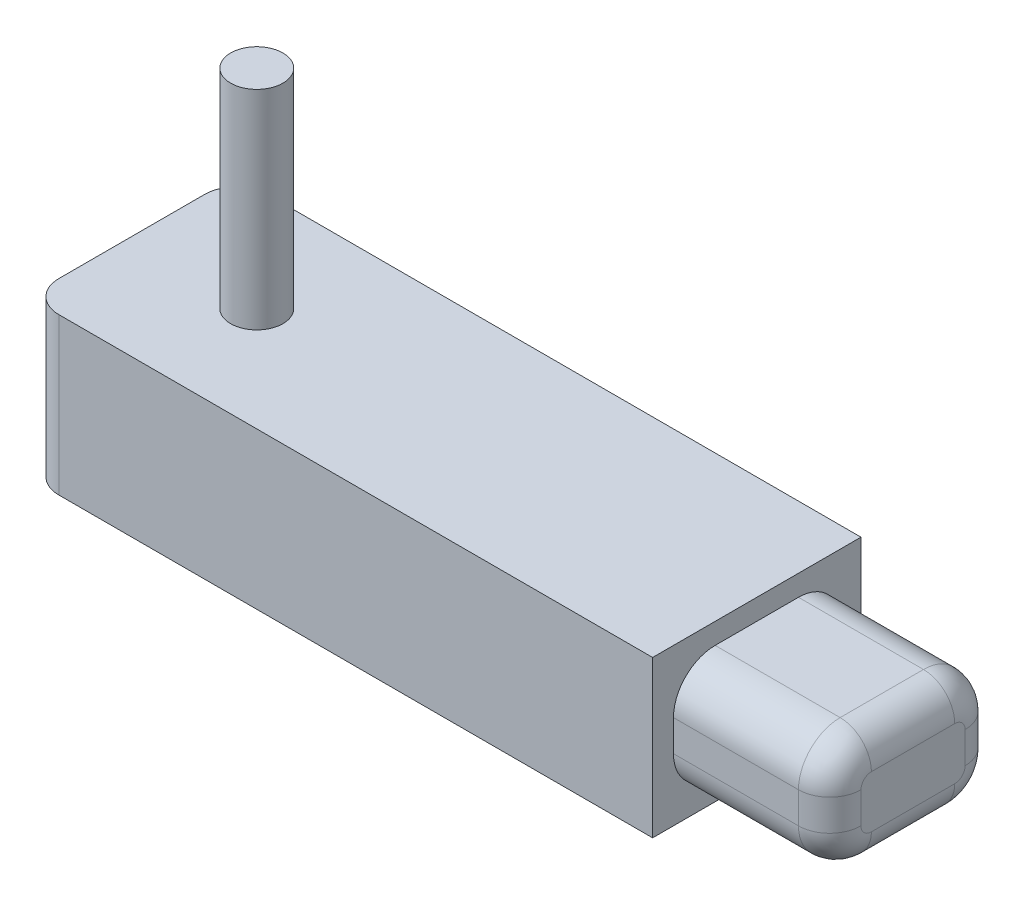
ISO-10303-21;
HEADER;
FILE_DESCRIPTION(('STEP AP214'),'2;1');
FILE_NAME('part.step','',(''),(''),'','','');
FILE_SCHEMA(('AUTOMOTIVE_DESIGN { 1 0 10303 214 1 1 1 1 }'));
ENDSEC;
DATA;
#1=APPLICATION_CONTEXT('core data for automotive mechanical design processes');
#2=APPLICATION_PROTOCOL_DEFINITION('international standard','automotive_design',2000,#1);
#3=PRODUCT_CONTEXT('',#1,'mechanical');
#4=PRODUCT('Part','Part','',(#3));
#5=PRODUCT_RELATED_PRODUCT_CATEGORY('part','',(#4));
#6=PRODUCT_DEFINITION_FORMATION('','',#4);
#7=PRODUCT_DEFINITION_CONTEXT('part definition',#1,'design');
#8=PRODUCT_DEFINITION('design','',#6,#7);
#9=PRODUCT_DEFINITION_SHAPE('','',#8);
#10=(LENGTH_UNIT() NAMED_UNIT(*) SI_UNIT(.MILLI.,.METRE.));
#11=(NAMED_UNIT(*) PLANE_ANGLE_UNIT() SI_UNIT($,.RADIAN.));
#12=(NAMED_UNIT(*) SI_UNIT($,.STERADIAN.) SOLID_ANGLE_UNIT());
#13=UNCERTAINTY_MEASURE_WITH_UNIT(LENGTH_MEASURE(1.E-05),#10,'distance_accuracy_value','');
#14=(GEOMETRIC_REPRESENTATION_CONTEXT(3) GLOBAL_UNCERTAINTY_ASSIGNED_CONTEXT((#13)) GLOBAL_UNIT_ASSIGNED_CONTEXT((#10,
#11,#12)) REPRESENTATION_CONTEXT('',''));
#15=CARTESIAN_POINT('',(0.,0.,0.));
#16=DIRECTION('',(0.,0.,1.));
#17=DIRECTION('',(1.,0.,0.));
#18=AXIS2_PLACEMENT_3D('',#15,#16,#17);
#19=CARTESIAN_POINT('',(10.875,7.0300987640225,20.));
#20=DIRECTION('',(-1.,0.,0.));
#21=DIRECTION('',(0.,-1.,0.));
#22=AXIS2_PLACEMENT_3D('',#19,#20,#21);
#23=PLANE('',#22);
#24=DIRECTION('',(0.,1.,0.));
#25=VECTOR('',#24,1.);
#26=CARTESIAN_POINT('',(10.875,7.0300987640225,0.));
#27=LINE('',#26,#25);
#28=CARTESIAN_POINT('',(10.875,-7.9699012359775,0.));
#29=VERTEX_POINT('',#28);
#30=CARTESIAN_POINT('',(10.875,7.0300987640225,0.));
#31=VERTEX_POINT('',#30);
#32=EDGE_CURVE('E210',#29,#31,#27,.T.);
#33=ORIENTED_EDGE('',*,*,#32,.T.);
#34=DIRECTION('',(0.,0.,-1.));
#35=VECTOR('',#34,1.);
#36=CARTESIAN_POINT('',(10.875,7.0300987640225,20.));
#37=LINE('',#36,#35);
#38=CARTESIAN_POINT('',(10.875,7.0300987640225,20.));
#39=VERTEX_POINT('',#38);
#40=EDGE_CURVE('E195',#39,#31,#37,.T.);
#41=ORIENTED_EDGE('',*,*,#40,.F.);
#42=DIRECTION('',(0.,1.,0.));
#43=VECTOR('',#42,1.);
#44=CARTESIAN_POINT('',(10.875,7.0300987640225,20.));
#45=LINE('',#44,#43);
#46=CARTESIAN_POINT('',(10.875,-7.9699012359775,20.));
#47=VERTEX_POINT('',#46);
#48=EDGE_CURVE('E179',#47,#39,#45,.T.);
#49=ORIENTED_EDGE('',*,*,#48,.F.);
#50=DIRECTION('',(0.,0.,-1.));
#51=VECTOR('',#50,1.);
#52=CARTESIAN_POINT('',(10.875,-7.9699012359775,20.));
#53=LINE('',#52,#51);
#54=EDGE_CURVE('E188',#47,#29,#53,.T.);
#55=ORIENTED_EDGE('',*,*,#54,.T.);
#56=EDGE_LOOP('',(#33,#41,#49,#55));
#57=FACE_BOUND('',#56,.T.);
#58=DIRECTION('',(0.,1.,0.));
#59=VECTOR('',#58,1.);
#60=CARTESIAN_POINT('',(10.875,-5.9699012359775,2.));
#61=LINE('',#60,#59);
#62=CARTESIAN_POINT('',(10.875,-1.9699012359775,2.));
#63=VERTEX_POINT('',#62);
#64=CARTESIAN_POINT('',(10.875,1.0300987640225,2.));
#65=VERTEX_POINT('',#64);
#66=EDGE_CURVE('E348',#63,#65,#61,.T.);
#67=ORIENTED_EDGE('',*,*,#66,.F.);
#68=CARTESIAN_POINT('',(10.875,-1.9699012359775,6.));
#69=DIRECTION('',(-1.,0.,0.));
#70=DIRECTION('',(0.,-1.,0.));
#71=AXIS2_PLACEMENT_3D('',#68,#69,#70);
#72=CIRCLE('',#71,4.);
#73=CARTESIAN_POINT('',(10.875,-5.9699012359775,6.));
#74=VERTEX_POINT('',#73);
#75=EDGE_CURVE('E265',#63,#74,#72,.T.);
#76=ORIENTED_EDGE('',*,*,#75,.T.);
#77=DIRECTION('',(0.,0.,-1.));
#78=VECTOR('',#77,1.);
#79=CARTESIAN_POINT('',(10.875,-5.9699012359775,18.));
#80=LINE('',#79,#78);
#81=CARTESIAN_POINT('',(10.875,-5.9699012359775,14.));
#82=VERTEX_POINT('',#81);
#83=EDGE_CURVE('E676',#82,#74,#80,.T.);
#84=ORIENTED_EDGE('',*,*,#83,.F.);
#85=CARTESIAN_POINT('',(10.875,-1.9699012359775,14.));
#86=DIRECTION('',(-1.,0.,0.));
#87=DIRECTION('',(0.,-1.,0.));
#88=AXIS2_PLACEMENT_3D('',#85,#86,#87);
#89=CIRCLE('',#88,4.);
#90=CARTESIAN_POINT('',(10.875,-1.9699012359775,18.));
#91=VERTEX_POINT('',#90);
#92=EDGE_CURVE('E262',#82,#91,#89,.T.);
#93=ORIENTED_EDGE('',*,*,#92,.T.);
#94=DIRECTION('',(0.,-1.,0.));
#95=VECTOR('',#94,1.);
#96=CARTESIAN_POINT('',(10.875,-5.9699012359775,18.));
#97=LINE('',#96,#95);
#98=CARTESIAN_POINT('',(10.875,1.0300987640225,18.));
#99=VERTEX_POINT('',#98);
#100=EDGE_CURVE('E679',#99,#91,#97,.T.);
#101=ORIENTED_EDGE('',*,*,#100,.F.);
#102=CARTESIAN_POINT('',(10.875,1.0300987640225,14.));
#103=DIRECTION('',(-1.,0.,0.));
#104=DIRECTION('',(0.,-1.,0.));
#105=AXIS2_PLACEMENT_3D('',#102,#103,#104);
#106=CIRCLE('',#105,4.);
#107=CARTESIAN_POINT('',(10.875,5.0300987640225,14.));
#108=VERTEX_POINT('',#107);
#109=EDGE_CURVE('E245',#99,#108,#106,.T.);
#110=ORIENTED_EDGE('',*,*,#109,.T.);
#111=DIRECTION('',(0.,0.,1.));
#112=VECTOR('',#111,1.);
#113=CARTESIAN_POINT('',(10.875,5.0300987640225,18.));
#114=LINE('',#113,#112);
#115=CARTESIAN_POINT('',(10.875,5.0300987640225,6.));
#116=VERTEX_POINT('',#115);
#117=EDGE_CURVE('E685',#116,#108,#114,.T.);
#118=ORIENTED_EDGE('',*,*,#117,.F.);
#119=CARTESIAN_POINT('',(10.875,1.0300987640225,6.));
#120=DIRECTION('',(-1.,0.,0.));
#121=DIRECTION('',(0.,-1.,0.));
#122=AXIS2_PLACEMENT_3D('',#119,#120,#121);
#123=CIRCLE('',#122,4.);
#124=EDGE_CURVE('E234',#116,#65,#123,.T.);
#125=ORIENTED_EDGE('',*,*,#124,.T.);
#126=EDGE_LOOP('',(#67,#76,#84,#93,#101,#110,#118,#125));
#127=FACE_BOUND('',#126,.T.);
#128=ADVANCED_FACE('F47',(#57,#127),#23,.F.);
#129=CARTESIAN_POINT('',(-49.125,-7.96990123597754,20.));
#130=DIRECTION('',(1.,0.,0.));
#131=DIRECTION('',(0.,0.,-1.));
#132=AXIS2_PLACEMENT_3D('',#129,#130,#131);
#133=PLANE('',#132);
#134=DIRECTION('',(0.,0.,-1.));
#135=VECTOR('',#134,1.);
#136=CARTESIAN_POINT('',(-49.125,-7.96990123597754,20.));
#137=LINE('',#136,#135);
#138=CARTESIAN_POINT('',(-49.125,-7.96990123597754,17.));
#139=VERTEX_POINT('',#138);
#140=CARTESIAN_POINT('',(-49.125,-7.96990123597754,3.));
#141=VERTEX_POINT('',#140);
#142=EDGE_CURVE('E194',#139,#141,#137,.T.);
#143=ORIENTED_EDGE('',*,*,#142,.F.);
#144=DIRECTION('',(0.,-1.,0.));
#145=VECTOR('',#144,1.);
#146=CARTESIAN_POINT('',(-49.125,-7.96990123597754,17.));
#147=LINE('',#146,#145);
#148=CARTESIAN_POINT('',(-49.125,7.03009876402245,17.));
#149=VERTEX_POINT('',#148);
#150=EDGE_CURVE('E361',#139,#149,#147,.F.);
#151=ORIENTED_EDGE('',*,*,#150,.T.);
#152=DIRECTION('',(0.,0.,-1.));
#153=VECTOR('',#152,1.);
#154=CARTESIAN_POINT('',(-49.125,7.03009876402245,20.));
#155=LINE('',#154,#153);
#156=CARTESIAN_POINT('',(-49.125,7.03009876402245,3.));
#157=VERTEX_POINT('',#156);
#158=EDGE_CURVE('E204',#149,#157,#155,.T.);
#159=ORIENTED_EDGE('',*,*,#158,.T.);
#160=DIRECTION('',(0.,-1.,0.));
#161=VECTOR('',#160,1.);
#162=CARTESIAN_POINT('',(-49.125,-7.96990123597754,3.));
#163=LINE('',#162,#161);
#164=EDGE_CURVE('E357',#157,#141,#163,.T.);
#165=ORIENTED_EDGE('',*,*,#164,.T.);
#166=EDGE_LOOP('',(#143,#151,#159,#165));
#167=FACE_BOUND('',#166,.T.);
#168=ADVANCED_FACE('F373',(#167),#133,.F.);
#169=CARTESIAN_POINT('',(10.875,-7.9699012359775,20.));
#170=DIRECTION('',(0.,1.,0.));
#171=DIRECTION('',(-1.,0.,0.));
#172=AXIS2_PLACEMENT_3D('',#169,#170,#171);
#173=PLANE('',#172);
#174=DIRECTION('',(1.,0.,0.));
#175=VECTOR('',#174,1.);
#176=CARTESIAN_POINT('',(10.875,-7.9699012359775,20.));
#177=LINE('',#176,#175);
#178=CARTESIAN_POINT('',(-46.125,-7.96990123597754,20.));
#179=VERTEX_POINT('',#178);
#180=EDGE_CURVE('E174',#179,#47,#177,.T.);
#181=ORIENTED_EDGE('',*,*,#180,.F.);
#182=CARTESIAN_POINT('',(-46.125,-7.96990123597754,17.));
#183=DIRECTION('',(0.,1.,0.));
#184=DIRECTION('',(-1.,0.,0.));
#185=AXIS2_PLACEMENT_3D('',#182,#183,#184);
#186=CIRCLE('',#185,3.);
#187=EDGE_CURVE('E354',#179,#139,#186,.F.);
#188=ORIENTED_EDGE('',*,*,#187,.T.);
#189=ORIENTED_EDGE('',*,*,#142,.T.);
#190=CARTESIAN_POINT('',(-46.125,-7.96990123597754,3.));
#191=DIRECTION('',(0.,1.,0.));
#192=DIRECTION('',(-1.,0.,0.));
#193=AXIS2_PLACEMENT_3D('',#190,#191,#192);
#194=CIRCLE('',#193,3.);
#195=CARTESIAN_POINT('',(-46.125,-7.96990123597754,0.));
#196=VERTEX_POINT('',#195);
#197=EDGE_CURVE('E351',#141,#196,#194,.F.);
#198=ORIENTED_EDGE('',*,*,#197,.T.);
#199=DIRECTION('',(1.,0.,0.));
#200=VECTOR('',#199,1.);
#201=CARTESIAN_POINT('',(10.875,-7.9699012359775,0.));
#202=LINE('',#201,#200);
#203=EDGE_CURVE('E190',#196,#29,#202,.T.);
#204=ORIENTED_EDGE('',*,*,#203,.T.);
#205=ORIENTED_EDGE('',*,*,#54,.F.);
#206=EDGE_LOOP('',(#181,#188,#189,#198,#204,#205));
#207=FACE_BOUND('',#206,.T.);
#208=ADVANCED_FACE('F189',(#207),#173,.F.);
#209=CARTESIAN_POINT('',(-49.125,7.03009876402245,20.));
#210=DIRECTION('',(0.,-1.,0.));
#211=DIRECTION('',(1.,0.,0.));
#212=AXIS2_PLACEMENT_3D('',#209,#210,#211);
#213=PLANE('',#212);
#214=CARTESIAN_POINT('',(-37.125,7.03009876402247,10.));
#215=DIRECTION('',(0.,-1.,0.));
#216=DIRECTION('',(1.,0.,0.));
#217=AXIS2_PLACEMENT_3D('',#214,#215,#216);
#218=CIRCLE('',#217,2.5097667527526);
#219=CARTESIAN_POINT('',(-34.6152332472474,7.03009876402247,10.));
#220=VERTEX_POINT('',#219);
#221=EDGE_CURVE('E223',#220,#220,#218,.F.);
#222=ORIENTED_EDGE('',*,*,#221,.F.);
#223=EDGE_LOOP('',(#222));
#224=FACE_BOUND('',#223,.T.);
#225=ORIENTED_EDGE('',*,*,#158,.F.);
#226=CARTESIAN_POINT('',(-46.125,7.03009876402246,17.));
#227=DIRECTION('',(0.,-1.,0.));
#228=DIRECTION('',(1.,0.,0.));
#229=AXIS2_PLACEMENT_3D('',#226,#227,#228);
#230=CIRCLE('',#229,3.);
#231=CARTESIAN_POINT('',(-46.125,7.03009876402246,20.));
#232=VERTEX_POINT('',#231);
#233=EDGE_CURVE('E56',#149,#232,#230,.F.);
#234=ORIENTED_EDGE('',*,*,#233,.T.);
#235=DIRECTION('',(-1.,0.,0.));
#236=VECTOR('',#235,1.);
#237=CARTESIAN_POINT('',(-49.125,7.03009876402245,20.));
#238=LINE('',#237,#236);
#239=EDGE_CURVE('E201',#39,#232,#238,.T.);
#240=ORIENTED_EDGE('',*,*,#239,.F.);
#241=ORIENTED_EDGE('',*,*,#40,.T.);
#242=DIRECTION('',(-1.,0.,0.));
#243=VECTOR('',#242,1.);
#244=CARTESIAN_POINT('',(-49.125,7.03009876402245,0.));
#245=LINE('',#244,#243);
#246=CARTESIAN_POINT('',(-46.125,7.03009876402246,0.));
#247=VERTEX_POINT('',#246);
#248=EDGE_CURVE('E185',#31,#247,#245,.T.);
#249=ORIENTED_EDGE('',*,*,#248,.T.);
#250=CARTESIAN_POINT('',(-46.125,7.03009876402246,3.));
#251=DIRECTION('',(0.,-1.,0.));
#252=DIRECTION('',(1.,0.,0.));
#253=AXIS2_PLACEMENT_3D('',#250,#251,#252);
#254=CIRCLE('',#253,3.);
#255=EDGE_CURVE('E68',#247,#157,#254,.F.);
#256=ORIENTED_EDGE('',*,*,#255,.T.);
#257=EDGE_LOOP('',(#225,#234,#240,#241,#249,#256));
#258=FACE_BOUND('',#257,.T.);
#259=ADVANCED_FACE('F367',(#224,#258),#213,.F.);
#260=CARTESIAN_POINT('',(0.,0.,20.));
#261=DIRECTION('',(0.,0.,-1.));
#262=DIRECTION('',(-1.,0.,0.));
#263=AXIS2_PLACEMENT_3D('',#260,#261,#262);
#264=PLANE('',#263);
#265=ORIENTED_EDGE('',*,*,#239,.T.);
#266=DIRECTION('',(0.,-1.,0.));
#267=VECTOR('',#266,1.);
#268=CARTESIAN_POINT('',(-46.125,0.,20.));
#269=LINE('',#268,#267);
#270=EDGE_CURVE('E182',#232,#179,#269,.T.);
#271=ORIENTED_EDGE('',*,*,#270,.T.);
#272=ORIENTED_EDGE('',*,*,#180,.T.);
#273=ORIENTED_EDGE('',*,*,#48,.T.);
#274=EDGE_LOOP('',(#265,#271,#272,#273));
#275=FACE_BOUND('',#274,.T.);
#276=ADVANCED_FACE('F177',(#275),#264,.F.);
#277=CARTESIAN_POINT('',(0.,0.,0.));
#278=DIRECTION('',(0.,0.,-1.));
#279=DIRECTION('',(-1.,0.,0.));
#280=AXIS2_PLACEMENT_3D('',#277,#278,#279);
#281=PLANE('',#280);
#282=ORIENTED_EDGE('',*,*,#203,.F.);
#283=DIRECTION('',(0.,-1.,0.));
#284=VECTOR('',#283,1.);
#285=CARTESIAN_POINT('',(-46.125,7.03009876402245,0.));
#286=LINE('',#285,#284);
#287=EDGE_CURVE('E11',#196,#247,#286,.F.);
#288=ORIENTED_EDGE('',*,*,#287,.T.);
#289=ORIENTED_EDGE('',*,*,#248,.F.);
#290=ORIENTED_EDGE('',*,*,#32,.F.);
#291=EDGE_LOOP('',(#282,#288,#289,#290));
#292=FACE_BOUND('',#291,.T.);
#293=ADVANCED_FACE('F376',(#292),#281,.T.);
#294=CARTESIAN_POINT('',(-37.125,27.0300987640225,10.));
#295=DIRECTION('',(0.,-1.,0.));
#296=DIRECTION('',(1.,0.,0.));
#297=AXIS2_PLACEMENT_3D('',#294,#295,#296);
#298=CYLINDRICAL_SURFACE('',#297,2.5097667527526);
#299=CARTESIAN_POINT('',(-37.125,27.0300987640225,10.));
#300=DIRECTION('',(0.,1.,0.));
#301=DIRECTION('',(-1.,0.,0.));
#302=AXIS2_PLACEMENT_3D('',#299,#300,#301);
#303=CIRCLE('',#302,2.5097667527526);
#304=CARTESIAN_POINT('',(-39.6347667527526,27.0300987640225,10.));
#305=VERTEX_POINT('',#304);
#306=EDGE_CURVE('E211',#305,#305,#303,.T.);
#307=ORIENTED_EDGE('',*,*,#306,.F.);
#308=EDGE_LOOP('',(#307));
#309=FACE_BOUND('',#308,.T.);
#310=ORIENTED_EDGE('',*,*,#221,.T.);
#311=EDGE_LOOP('',(#310));
#312=FACE_BOUND('',#311,.T.);
#313=ADVANCED_FACE('F378',(#309,#312),#298,.T.);
#314=CARTESIAN_POINT('',(0.,27.0300987640225,0.));
#315=DIRECTION('',(0.,1.,0.));
#316=DIRECTION('',(-1.,0.,0.));
#317=AXIS2_PLACEMENT_3D('',#314,#315,#316);
#318=PLANE('',#317);
#319=ORIENTED_EDGE('',*,*,#306,.T.);
#320=EDGE_LOOP('',(#319));
#321=FACE_BOUND('',#320,.T.);
#322=ADVANCED_FACE('F384',(#321),#318,.T.);
#323=CARTESIAN_POINT('',(25.875,-5.96990123597749,2.));
#324=DIRECTION('',(0.,0.,1.));
#325=DIRECTION('',(1.,0.,0.));
#326=AXIS2_PLACEMENT_3D('',#323,#324,#325);
#327=PLANE('',#326);
#328=DIRECTION('',(-1.,0.,0.));
#329=VECTOR('',#328,1.);
#330=CARTESIAN_POINT('',(25.875,1.03009876402251,2.));
#331=LINE('',#330,#329);
#332=CARTESIAN_POINT('',(22.875,1.0300987640225,2.));
#333=VERTEX_POINT('',#332);
#334=EDGE_CURVE('E230',#65,#333,#331,.F.);
#335=ORIENTED_EDGE('',*,*,#334,.T.);
#336=DIRECTION('',(0.,1.,0.));
#337=VECTOR('',#336,1.);
#338=CARTESIAN_POINT('',(22.875,-5.9699012359775,2.));
#339=LINE('',#338,#337);
#340=CARTESIAN_POINT('',(22.875,-1.9699012359775,2.));
#341=VERTEX_POINT('',#340);
#342=EDGE_CURVE('E297',#333,#341,#339,.F.);
#343=ORIENTED_EDGE('',*,*,#342,.T.);
#344=DIRECTION('',(-1.,0.,0.));
#345=VECTOR('',#344,1.);
#346=CARTESIAN_POINT('',(25.875,-1.96990123597749,2.));
#347=LINE('',#346,#345);
#348=EDGE_CURVE('E259',#341,#63,#347,.T.);
#349=ORIENTED_EDGE('',*,*,#348,.T.);
#350=ORIENTED_EDGE('',*,*,#66,.T.);
#351=EDGE_LOOP('',(#335,#343,#349,#350));
#352=FACE_BOUND('',#351,.T.);
#353=ADVANCED_FACE('F621',(#352),#327,.F.);
#354=CARTESIAN_POINT('',(25.875,5.03009876402251,18.));
#355=DIRECTION('',(0.,-1.,0.));
#356=DIRECTION('',(1.,0.,0.));
#357=AXIS2_PLACEMENT_3D('',#354,#355,#356);
#358=PLANE('',#357);
#359=DIRECTION('',(-1.,0.,0.));
#360=VECTOR('',#359,1.);
#361=CARTESIAN_POINT('',(25.875,5.03009876402251,14.));
#362=LINE('',#361,#360);
#363=CARTESIAN_POINT('',(22.875,5.03009876402251,14.));
#364=VERTEX_POINT('',#363);
#365=EDGE_CURVE('E241',#108,#364,#362,.F.);
#366=ORIENTED_EDGE('',*,*,#365,.T.);
#367=DIRECTION('',(0.,0.,1.));
#368=VECTOR('',#367,1.);
#369=CARTESIAN_POINT('',(22.875,5.03009876402251,18.));
#370=LINE('',#369,#368);
#371=CARTESIAN_POINT('',(22.875,5.03009876402251,6.));
#372=VERTEX_POINT('',#371);
#373=EDGE_CURVE('E315',#364,#372,#370,.F.);
#374=ORIENTED_EDGE('',*,*,#373,.T.);
#375=DIRECTION('',(-1.,0.,0.));
#376=VECTOR('',#375,1.);
#377=CARTESIAN_POINT('',(25.875,5.03009876402251,6.));
#378=LINE('',#377,#376);
#379=EDGE_CURVE('E227',#372,#116,#378,.T.);
#380=ORIENTED_EDGE('',*,*,#379,.T.);
#381=ORIENTED_EDGE('',*,*,#117,.T.);
#382=EDGE_LOOP('',(#366,#374,#380,#381));
#383=FACE_BOUND('',#382,.T.);
#384=ADVANCED_FACE('F611',(#383),#358,.F.);
#385=CARTESIAN_POINT('',(25.875,-5.96990123597749,18.));
#386=DIRECTION('',(0.,0.,-1.));
#387=DIRECTION('',(-1.,0.,0.));
#388=AXIS2_PLACEMENT_3D('',#385,#386,#387);
#389=PLANE('',#388);
#390=DIRECTION('',(-1.,0.,0.));
#391=VECTOR('',#390,1.);
#392=CARTESIAN_POINT('',(25.875,-1.96990123597749,18.));
#393=LINE('',#392,#391);
#394=CARTESIAN_POINT('',(22.875,-1.9699012359775,18.));
#395=VERTEX_POINT('',#394);
#396=EDGE_CURVE('E255',#91,#395,#393,.F.);
#397=ORIENTED_EDGE('',*,*,#396,.T.);
#398=DIRECTION('',(0.,-1.,0.));
#399=VECTOR('',#398,1.);
#400=CARTESIAN_POINT('',(22.875,-5.9699012359775,18.));
#401=LINE('',#400,#399);
#402=CARTESIAN_POINT('',(22.875,1.0300987640225,18.));
#403=VERTEX_POINT('',#402);
#404=EDGE_CURVE('E309',#395,#403,#401,.F.);
#405=ORIENTED_EDGE('',*,*,#404,.T.);
#406=DIRECTION('',(-1.,0.,0.));
#407=VECTOR('',#406,1.);
#408=CARTESIAN_POINT('',(25.875,1.03009876402251,18.));
#409=LINE('',#408,#407);
#410=EDGE_CURVE('E238',#403,#99,#409,.T.);
#411=ORIENTED_EDGE('',*,*,#410,.T.);
#412=ORIENTED_EDGE('',*,*,#100,.T.);
#413=EDGE_LOOP('',(#397,#405,#411,#412));
#414=FACE_BOUND('',#413,.T.);
#415=ADVANCED_FACE('F601',(#414),#389,.F.);
#416=CARTESIAN_POINT('',(25.875,-5.96990123597749,18.));
#417=DIRECTION('',(0.,1.,0.));
#418=DIRECTION('',(-1.,0.,0.));
#419=AXIS2_PLACEMENT_3D('',#416,#417,#418);
#420=PLANE('',#419);
#421=DIRECTION('',(-1.,0.,0.));
#422=VECTOR('',#421,1.);
#423=CARTESIAN_POINT('',(25.875,-5.96990123597749,6.));
#424=LINE('',#423,#422);
#425=CARTESIAN_POINT('',(22.875,-5.9699012359775,6.));
#426=VERTEX_POINT('',#425);
#427=EDGE_CURVE('E248',#74,#426,#424,.F.);
#428=ORIENTED_EDGE('',*,*,#427,.T.);
#429=DIRECTION('',(0.,0.,-1.));
#430=VECTOR('',#429,1.);
#431=CARTESIAN_POINT('',(22.875,-5.9699012359775,18.));
#432=LINE('',#431,#430);
#433=CARTESIAN_POINT('',(22.875,-5.9699012359775,14.));
#434=VERTEX_POINT('',#433);
#435=EDGE_CURVE('E303',#426,#434,#432,.F.);
#436=ORIENTED_EDGE('',*,*,#435,.T.);
#437=DIRECTION('',(-1.,0.,0.));
#438=VECTOR('',#437,1.);
#439=CARTESIAN_POINT('',(25.875,-5.96990123597749,14.));
#440=LINE('',#439,#438);
#441=EDGE_CURVE('E252',#434,#82,#440,.T.);
#442=ORIENTED_EDGE('',*,*,#441,.T.);
#443=ORIENTED_EDGE('',*,*,#83,.T.);
#444=EDGE_LOOP('',(#428,#436,#442,#443));
#445=FACE_BOUND('',#444,.T.);
#446=ADVANCED_FACE('F591',(#445),#420,.F.);
#447=CARTESIAN_POINT('',(25.875,0.,0.));
#448=DIRECTION('',(-1.,0.,0.));
#449=DIRECTION('',(0.,-1.,0.));
#450=AXIS2_PLACEMENT_3D('',#447,#448,#449);
#451=PLANE('',#450);
#452=DIRECTION('',(0.,1.,0.));
#453=VECTOR('',#452,1.);
#454=CARTESIAN_POINT('',(25.875,0.,5.));
#455=LINE('',#454,#453);
#456=CARTESIAN_POINT('',(25.875,-1.96990123597749,5.));
#457=VERTEX_POINT('',#456);
#458=CARTESIAN_POINT('',(25.875,1.03009876402251,5.));
#459=VERTEX_POINT('',#458);
#460=EDGE_CURVE('E286',#457,#459,#455,.T.);
#461=ORIENTED_EDGE('',*,*,#460,.T.);
#462=CARTESIAN_POINT('',(25.875,1.03009876402251,6.));
#463=DIRECTION('',(-1.,0.,0.));
#464=DIRECTION('',(0.,-1.,0.));
#465=AXIS2_PLACEMENT_3D('',#462,#463,#464);
#466=CIRCLE('',#465,1.);
#467=CARTESIAN_POINT('',(25.875,2.03009876402251,6.));
#468=VERTEX_POINT('',#467);
#469=EDGE_CURVE('E289',#459,#468,#466,.F.);
#470=ORIENTED_EDGE('',*,*,#469,.T.);
#471=DIRECTION('',(0.,0.,1.));
#472=VECTOR('',#471,1.);
#473=CARTESIAN_POINT('',(25.875,2.03009876402251,0.));
#474=LINE('',#473,#472);
#475=CARTESIAN_POINT('',(25.875,2.03009876402251,14.));
#476=VERTEX_POINT('',#475);
#477=EDGE_CURVE('E268',#468,#476,#474,.T.);
#478=ORIENTED_EDGE('',*,*,#477,.T.);
#479=CARTESIAN_POINT('',(25.875,1.03009876402251,14.));
#480=DIRECTION('',(-1.,0.,0.));
#481=DIRECTION('',(0.,-1.,0.));
#482=AXIS2_PLACEMENT_3D('',#479,#480,#481);
#483=CIRCLE('',#482,1.);
#484=CARTESIAN_POINT('',(25.875,1.03009876402251,15.));
#485=VERTEX_POINT('',#484);
#486=EDGE_CURVE('E271',#476,#485,#483,.F.);
#487=ORIENTED_EDGE('',*,*,#486,.T.);
#488=DIRECTION('',(0.,-1.,0.));
#489=VECTOR('',#488,1.);
#490=CARTESIAN_POINT('',(25.875,0.,15.));
#491=LINE('',#490,#489);
#492=CARTESIAN_POINT('',(25.875,-1.96990123597749,15.));
#493=VERTEX_POINT('',#492);
#494=EDGE_CURVE('E274',#485,#493,#491,.T.);
#495=ORIENTED_EDGE('',*,*,#494,.T.);
#496=CARTESIAN_POINT('',(25.875,-1.96990123597749,14.));
#497=DIRECTION('',(-1.,0.,0.));
#498=DIRECTION('',(0.,-1.,0.));
#499=AXIS2_PLACEMENT_3D('',#496,#497,#498);
#500=CIRCLE('',#499,1.);
#501=CARTESIAN_POINT('',(25.875,-2.96990123597749,14.));
#502=VERTEX_POINT('',#501);
#503=EDGE_CURVE('E277',#493,#502,#500,.F.);
#504=ORIENTED_EDGE('',*,*,#503,.T.);
#505=DIRECTION('',(0.,0.,-1.));
#506=VECTOR('',#505,1.);
#507=CARTESIAN_POINT('',(25.875,-2.96990123597749,0.));
#508=LINE('',#507,#506);
#509=CARTESIAN_POINT('',(25.875,-2.96990123597749,6.));
#510=VERTEX_POINT('',#509);
#511=EDGE_CURVE('E280',#502,#510,#508,.T.);
#512=ORIENTED_EDGE('',*,*,#511,.T.);
#513=CARTESIAN_POINT('',(25.875,-1.96990123597749,6.));
#514=DIRECTION('',(-1.,0.,0.));
#515=DIRECTION('',(0.,-1.,0.));
#516=AXIS2_PLACEMENT_3D('',#513,#514,#515);
#517=CIRCLE('',#516,1.);
#518=EDGE_CURVE('E283',#510,#457,#517,.F.);
#519=ORIENTED_EDGE('',*,*,#518,.T.);
#520=EDGE_LOOP('',(#461,#470,#478,#487,#495,#504,#512,#519));
#521=FACE_BOUND('',#520,.T.);
#522=ADVANCED_FACE('F402',(#521),#451,.F.);
#523=CARTESIAN_POINT('',(25.875,1.03009876402251,6.));
#524=DIRECTION('',(-1.,0.,0.));
#525=DIRECTION('',(0.,-1.,0.));
#526=AXIS2_PLACEMENT_3D('',#523,#524,#525);
#527=CYLINDRICAL_SURFACE('',#526,4.);
#528=ORIENTED_EDGE('',*,*,#379,.F.);
#529=CARTESIAN_POINT('',(22.875,1.0300987640225,6.));
#530=DIRECTION('',(-1.,0.,0.));
#531=DIRECTION('',(0.,-1.,0.));
#532=AXIS2_PLACEMENT_3D('',#529,#530,#531);
#533=CIRCLE('',#532,4.);
#534=EDGE_CURVE('E293',#372,#333,#533,.T.);
#535=ORIENTED_EDGE('',*,*,#534,.T.);
#536=ORIENTED_EDGE('',*,*,#334,.F.);
#537=ORIENTED_EDGE('',*,*,#124,.F.);
#538=EDGE_LOOP('',(#528,#535,#536,#537));
#539=FACE_BOUND('',#538,.T.);
#540=ADVANCED_FACE('F398',(#539),#527,.T.);
#541=CARTESIAN_POINT('',(25.875,1.03009876402251,14.));
#542=DIRECTION('',(-1.,0.,0.));
#543=DIRECTION('',(0.,-1.,0.));
#544=AXIS2_PLACEMENT_3D('',#541,#542,#543);
#545=CYLINDRICAL_SURFACE('',#544,4.);
#546=ORIENTED_EDGE('',*,*,#410,.F.);
#547=CARTESIAN_POINT('',(22.875,1.0300987640225,14.));
#548=DIRECTION('',(-1.,0.,0.));
#549=DIRECTION('',(0.,-1.,0.));
#550=AXIS2_PLACEMENT_3D('',#547,#548,#549);
#551=CIRCLE('',#550,4.);
#552=EDGE_CURVE('E312',#403,#364,#551,.T.);
#553=ORIENTED_EDGE('',*,*,#552,.T.);
#554=ORIENTED_EDGE('',*,*,#365,.F.);
#555=ORIENTED_EDGE('',*,*,#109,.F.);
#556=EDGE_LOOP('',(#546,#553,#554,#555));
#557=FACE_BOUND('',#556,.T.);
#558=ADVANCED_FACE('F401',(#557),#545,.T.);
#559=CARTESIAN_POINT('',(25.875,-1.96990123597749,14.));
#560=DIRECTION('',(-1.,0.,0.));
#561=DIRECTION('',(0.,-1.,0.));
#562=AXIS2_PLACEMENT_3D('',#559,#560,#561);
#563=CYLINDRICAL_SURFACE('',#562,4.);
#564=ORIENTED_EDGE('',*,*,#441,.F.);
#565=CARTESIAN_POINT('',(22.875,-1.9699012359775,14.));
#566=DIRECTION('',(-1.,0.,0.));
#567=DIRECTION('',(0.,-1.,0.));
#568=AXIS2_PLACEMENT_3D('',#565,#566,#567);
#569=CIRCLE('',#568,4.);
#570=EDGE_CURVE('E306',#434,#395,#569,.T.);
#571=ORIENTED_EDGE('',*,*,#570,.T.);
#572=ORIENTED_EDGE('',*,*,#396,.F.);
#573=ORIENTED_EDGE('',*,*,#92,.F.);
#574=EDGE_LOOP('',(#564,#571,#572,#573));
#575=FACE_BOUND('',#574,.T.);
#576=ADVANCED_FACE('F406',(#575),#563,.T.);
#577=CARTESIAN_POINT('',(25.875,-1.96990123597749,6.));
#578=DIRECTION('',(-1.,0.,0.));
#579=DIRECTION('',(0.,-1.,0.));
#580=AXIS2_PLACEMENT_3D('',#577,#578,#579);
#581=CYLINDRICAL_SURFACE('',#580,4.);
#582=ORIENTED_EDGE('',*,*,#348,.F.);
#583=CARTESIAN_POINT('',(22.875,-1.9699012359775,6.));
#584=DIRECTION('',(-1.,0.,0.));
#585=DIRECTION('',(0.,-1.,0.));
#586=AXIS2_PLACEMENT_3D('',#583,#584,#585);
#587=CIRCLE('',#586,4.);
#588=EDGE_CURVE('E300',#341,#426,#587,.T.);
#589=ORIENTED_EDGE('',*,*,#588,.T.);
#590=ORIENTED_EDGE('',*,*,#427,.F.);
#591=ORIENTED_EDGE('',*,*,#75,.F.);
#592=EDGE_LOOP('',(#582,#589,#590,#591));
#593=FACE_BOUND('',#592,.T.);
#594=ADVANCED_FACE('F410',(#593),#581,.T.);
#595=CARTESIAN_POINT('',(22.875,-1.9699012359775,14.));
#596=DIRECTION('',(-1.,0.,0.));
#597=DIRECTION('',(0.,-1.,0.));
#598=AXIS2_PLACEMENT_3D('',#595,#596,#597);
#599=DEGENERATE_TOROIDAL_SURFACE('',#598,1.,3.,.T.);
#600=CARTESIAN_POINT('',(22.875,-1.9699012359775,15.));
#601=DIRECTION('',(0.,1.,0.));
#602=DIRECTION('',(-1.,0.,0.));
#603=AXIS2_PLACEMENT_3D('',#600,#601,#602);
#604=CIRCLE('',#603,3.);
#605=EDGE_CURVE('E340',#395,#493,#604,.T.);
#606=ORIENTED_EDGE('',*,*,#605,.F.);
#607=ORIENTED_EDGE('',*,*,#570,.F.);
#608=CARTESIAN_POINT('',(22.875,-2.9699012359775,14.));
#609=DIRECTION('',(0.,0.,-1.));
#610=DIRECTION('',(-1.,0.,0.));
#611=AXIS2_PLACEMENT_3D('',#608,#609,#610);
#612=CIRCLE('',#611,3.);
#613=EDGE_CURVE('E344',#502,#434,#612,.T.);
#614=ORIENTED_EDGE('',*,*,#613,.F.);
#615=ORIENTED_EDGE('',*,*,#503,.F.);
#616=EDGE_LOOP('',(#606,#607,#614,#615));
#617=FACE_BOUND('',#616,.T.);
#618=ADVANCED_FACE('F414',(#617),#599,.T.);
#619=CARTESIAN_POINT('',(22.875,-2.9699012359775,0.));
#620=DIRECTION('',(0.,0.,-1.));
#621=DIRECTION('',(-1.,0.,0.));
#622=AXIS2_PLACEMENT_3D('',#619,#620,#621);
#623=CYLINDRICAL_SURFACE('',#622,3.);
#624=ORIENTED_EDGE('',*,*,#613,.T.);
#625=ORIENTED_EDGE('',*,*,#435,.F.);
#626=CARTESIAN_POINT('',(22.875,-2.9699012359775,6.));
#627=DIRECTION('',(0.,0.,-1.));
#628=DIRECTION('',(-1.,0.,0.));
#629=AXIS2_PLACEMENT_3D('',#626,#627,#628);
#630=CIRCLE('',#629,3.);
#631=EDGE_CURVE('E336',#510,#426,#630,.T.);
#632=ORIENTED_EDGE('',*,*,#631,.F.);
#633=ORIENTED_EDGE('',*,*,#511,.F.);
#634=EDGE_LOOP('',(#624,#625,#632,#633));
#635=FACE_BOUND('',#634,.T.);
#636=ADVANCED_FACE('F439',(#635),#623,.T.);
#637=CARTESIAN_POINT('',(22.875,0.,15.));
#638=DIRECTION('',(0.,-1.,0.));
#639=DIRECTION('',(1.,0.,0.));
#640=AXIS2_PLACEMENT_3D('',#637,#638,#639);
#641=CYLINDRICAL_SURFACE('',#640,3.);
#642=ORIENTED_EDGE('',*,*,#605,.T.);
#643=ORIENTED_EDGE('',*,*,#494,.F.);
#644=CARTESIAN_POINT('',(22.875,1.0300987640225,15.));
#645=DIRECTION('',(0.,1.,0.));
#646=DIRECTION('',(-1.,0.,0.));
#647=AXIS2_PLACEMENT_3D('',#644,#645,#646);
#648=CIRCLE('',#647,3.);
#649=EDGE_CURVE('E332',#403,#485,#648,.T.);
#650=ORIENTED_EDGE('',*,*,#649,.F.);
#651=ORIENTED_EDGE('',*,*,#404,.F.);
#652=EDGE_LOOP('',(#642,#643,#650,#651));
#653=FACE_BOUND('',#652,.T.);
#654=ADVANCED_FACE('F435',(#653),#641,.T.);
#655=CARTESIAN_POINT('',(22.875,-1.9699012359775,6.));
#656=DIRECTION('',(-1.,0.,0.));
#657=DIRECTION('',(0.,-1.,0.));
#658=AXIS2_PLACEMENT_3D('',#655,#656,#657);
#659=DEGENERATE_TOROIDAL_SURFACE('',#658,1.,3.,.T.);
#660=ORIENTED_EDGE('',*,*,#631,.T.);
#661=ORIENTED_EDGE('',*,*,#588,.F.);
#662=CARTESIAN_POINT('',(22.875,-1.9699012359775,5.));
#663=DIRECTION('',(0.,1.,0.));
#664=DIRECTION('',(-1.,0.,0.));
#665=AXIS2_PLACEMENT_3D('',#662,#663,#664);
#666=CIRCLE('',#665,3.);
#667=EDGE_CURVE('E328',#457,#341,#666,.T.);
#668=ORIENTED_EDGE('',*,*,#667,.F.);
#669=ORIENTED_EDGE('',*,*,#518,.F.);
#670=EDGE_LOOP('',(#660,#661,#668,#669));
#671=FACE_BOUND('',#670,.T.);
#672=ADVANCED_FACE('F431',(#671),#659,.T.);
#673=CARTESIAN_POINT('',(22.875,1.0300987640225,14.));
#674=DIRECTION('',(-1.,0.,0.));
#675=DIRECTION('',(0.,-1.,0.));
#676=AXIS2_PLACEMENT_3D('',#673,#674,#675);
#677=DEGENERATE_TOROIDAL_SURFACE('',#676,1.,3.,.T.);
#678=ORIENTED_EDGE('',*,*,#649,.T.);
#679=ORIENTED_EDGE('',*,*,#486,.F.);
#680=CARTESIAN_POINT('',(22.875,2.0300987640225,14.));
#681=DIRECTION('',(0.,0.,-1.));
#682=DIRECTION('',(-1.,0.,0.));
#683=AXIS2_PLACEMENT_3D('',#680,#681,#682);
#684=CIRCLE('',#683,3.);
#685=EDGE_CURVE('E324',#364,#476,#684,.T.);
#686=ORIENTED_EDGE('',*,*,#685,.F.);
#687=ORIENTED_EDGE('',*,*,#552,.F.);
#688=EDGE_LOOP('',(#678,#679,#686,#687));
#689=FACE_BOUND('',#688,.T.);
#690=ADVANCED_FACE('F427',(#689),#677,.T.);
#691=CARTESIAN_POINT('',(22.875,0.,5.));
#692=DIRECTION('',(0.,1.,0.));
#693=DIRECTION('',(-1.,0.,0.));
#694=AXIS2_PLACEMENT_3D('',#691,#692,#693);
#695=CYLINDRICAL_SURFACE('',#694,3.);
#696=ORIENTED_EDGE('',*,*,#667,.T.);
#697=ORIENTED_EDGE('',*,*,#342,.F.);
#698=CARTESIAN_POINT('',(22.875,1.0300987640225,5.));
#699=DIRECTION('',(0.,1.,0.));
#700=DIRECTION('',(-1.,0.,0.));
#701=AXIS2_PLACEMENT_3D('',#698,#699,#700);
#702=CIRCLE('',#701,3.);
#703=EDGE_CURVE('E321',#459,#333,#702,.T.);
#704=ORIENTED_EDGE('',*,*,#703,.F.);
#705=ORIENTED_EDGE('',*,*,#460,.F.);
#706=EDGE_LOOP('',(#696,#697,#704,#705));
#707=FACE_BOUND('',#706,.T.);
#708=ADVANCED_FACE('F423',(#707),#695,.T.);
#709=CARTESIAN_POINT('',(22.875,2.0300987640225,0.));
#710=DIRECTION('',(0.,0.,1.));
#711=DIRECTION('',(1.,0.,0.));
#712=AXIS2_PLACEMENT_3D('',#709,#710,#711);
#713=CYLINDRICAL_SURFACE('',#712,3.);
#714=ORIENTED_EDGE('',*,*,#685,.T.);
#715=ORIENTED_EDGE('',*,*,#477,.F.);
#716=CARTESIAN_POINT('',(22.875,2.0300987640225,6.));
#717=DIRECTION('',(0.,0.,-1.));
#718=DIRECTION('',(-1.,0.,0.));
#719=AXIS2_PLACEMENT_3D('',#716,#717,#718);
#720=CIRCLE('',#719,3.);
#721=EDGE_CURVE('E318',#372,#468,#720,.T.);
#722=ORIENTED_EDGE('',*,*,#721,.F.);
#723=ORIENTED_EDGE('',*,*,#373,.F.);
#724=EDGE_LOOP('',(#714,#715,#722,#723));
#725=FACE_BOUND('',#724,.T.);
#726=ADVANCED_FACE('F419',(#725),#713,.T.);
#727=CARTESIAN_POINT('',(22.875,1.0300987640225,6.));
#728=DIRECTION('',(-1.,0.,0.));
#729=DIRECTION('',(0.,-1.,0.));
#730=AXIS2_PLACEMENT_3D('',#727,#728,#729);
#731=DEGENERATE_TOROIDAL_SURFACE('',#730,1.,3.,.T.);
#732=ORIENTED_EDGE('',*,*,#703,.T.);
#733=ORIENTED_EDGE('',*,*,#534,.F.);
#734=ORIENTED_EDGE('',*,*,#721,.T.);
#735=ORIENTED_EDGE('',*,*,#469,.F.);
#736=EDGE_LOOP('',(#732,#733,#734,#735));
#737=FACE_BOUND('',#736,.T.);
#738=ADVANCED_FACE('F416',(#737),#731,.T.);
#739=CARTESIAN_POINT('',(-46.125,0.,17.));
#740=DIRECTION('',(0.,-1.,0.));
#741=DIRECTION('',(0.,0.,-1.));
#742=AXIS2_PLACEMENT_3D('',#739,#740,#741);
#743=CYLINDRICAL_SURFACE('',#742,3.);
#744=ORIENTED_EDGE('',*,*,#233,.F.);
#745=ORIENTED_EDGE('',*,*,#150,.F.);
#746=ORIENTED_EDGE('',*,*,#187,.F.);
#747=ORIENTED_EDGE('',*,*,#270,.F.);
#748=EDGE_LOOP('',(#744,#745,#746,#747));
#749=FACE_BOUND('',#748,.T.);
#750=ADVANCED_FACE('F370',(#749),#743,.T.);
#751=CARTESIAN_POINT('',(-46.125,-7.96990123597754,3.));
#752=DIRECTION('',(0.,1.,0.));
#753=DIRECTION('',(0.,0.,1.));
#754=AXIS2_PLACEMENT_3D('',#751,#752,#753);
#755=CYLINDRICAL_SURFACE('',#754,3.);
#756=ORIENTED_EDGE('',*,*,#255,.F.);
#757=ORIENTED_EDGE('',*,*,#287,.F.);
#758=ORIENTED_EDGE('',*,*,#197,.F.);
#759=ORIENTED_EDGE('',*,*,#164,.F.);
#760=EDGE_LOOP('',(#756,#757,#758,#759));
#761=FACE_BOUND('',#760,.T.);
#762=ADVANCED_FACE('F49',(#761),#755,.T.);
#763=CLOSED_SHELL('',(#128,#168,#208,#259,#276,#293,#313,#322,#353,#384,#415,#446,#522,#540,
#558,#576,#594,#618,#636,#654,#672,#690,#708,#726,#738,#750,#762));
#764=MANIFOLD_SOLID_BREP('B2',#763);
#765=ADVANCED_BREP_SHAPE_REPRESENTATION('',(#18,#764),#14);
#766=SHAPE_DEFINITION_REPRESENTATION(#9,#765);
ENDSEC;
END-ISO-10303-21;
